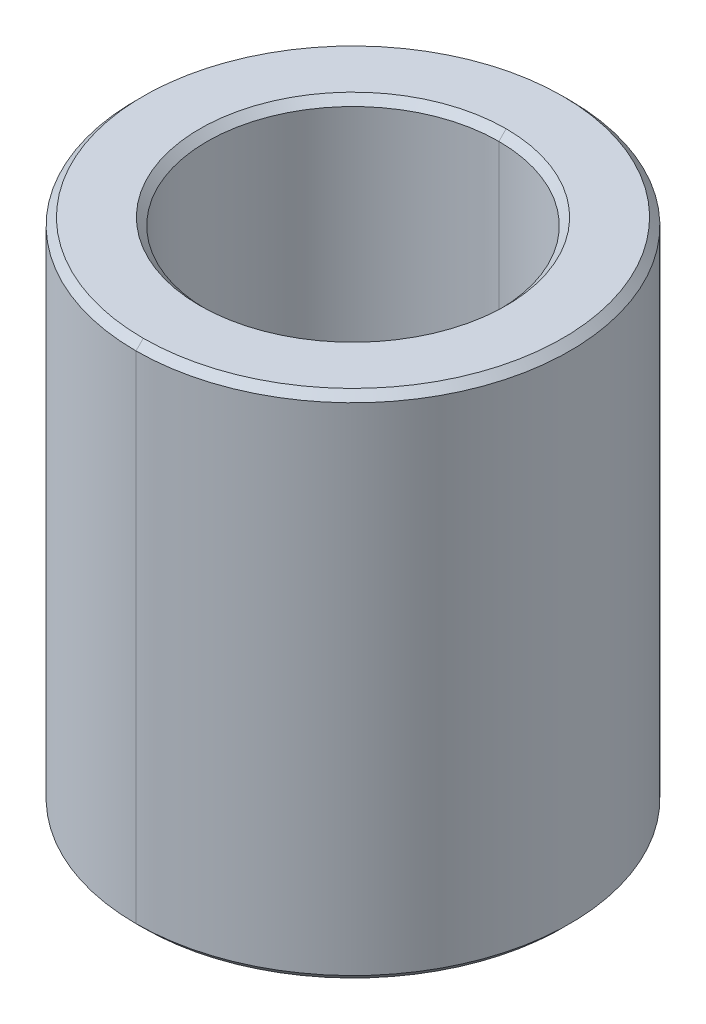
ISO-10303-21;
HEADER;
FILE_DESCRIPTION(('STEP AP214'),'2;1');
FILE_NAME('part.step','',(''),(''),'','','');
FILE_SCHEMA(('AUTOMOTIVE_DESIGN { 1 0 10303 214 1 1 1 1 }'));
ENDSEC;
DATA;
#1=APPLICATION_CONTEXT('core data for automotive mechanical design processes');
#2=APPLICATION_PROTOCOL_DEFINITION('international standard','automotive_design',2000,#1);
#3=PRODUCT_CONTEXT('',#1,'mechanical');
#4=PRODUCT('Part','Part','',(#3));
#5=PRODUCT_RELATED_PRODUCT_CATEGORY('part','',(#4));
#6=PRODUCT_DEFINITION_FORMATION('','',#4);
#7=PRODUCT_DEFINITION_CONTEXT('part definition',#1,'design');
#8=PRODUCT_DEFINITION('design','',#6,#7);
#9=PRODUCT_DEFINITION_SHAPE('','',#8);
#10=(LENGTH_UNIT() NAMED_UNIT(*) SI_UNIT(.MILLI.,.METRE.));
#11=(NAMED_UNIT(*) PLANE_ANGLE_UNIT() SI_UNIT($,.RADIAN.));
#12=(NAMED_UNIT(*) SI_UNIT($,.STERADIAN.) SOLID_ANGLE_UNIT());
#13=UNCERTAINTY_MEASURE_WITH_UNIT(LENGTH_MEASURE(1.E-05),#10,'distance_accuracy_value','');
#14=(GEOMETRIC_REPRESENTATION_CONTEXT(3) GLOBAL_UNCERTAINTY_ASSIGNED_CONTEXT((#13)) GLOBAL_UNIT_ASSIGNED_CONTEXT((#10,
#11,#12)) REPRESENTATION_CONTEXT('',''));
#15=CARTESIAN_POINT('',(0.,0.,0.));
#16=DIRECTION('',(0.,0.,1.));
#17=DIRECTION('',(1.,0.,0.));
#18=AXIS2_PLACEMENT_3D('',#15,#16,#17);
#19=CARTESIAN_POINT('',(0.,3.4,0.));
#20=DIRECTION('',(0.,1.,0.));
#21=DIRECTION('',(0.,0.,1.));
#22=AXIS2_PLACEMENT_3D('',#19,#20,#21);
#23=CONICAL_SURFACE('',#22,2.,0.78539816339745);
#24=DIRECTION('',(0.,0.707106781186546,-0.707106781186549));
#25=VECTOR('',#24,1.);
#26=CARTESIAN_POINT('',(0.,3.4,-2.));
#27=LINE('',#26,#25);
#28=CARTESIAN_POINT('',(0.,3.4,-2.));
#29=VERTEX_POINT('',#28);
#30=CARTESIAN_POINT('',(0.,3.5,-2.1));
#31=VERTEX_POINT('',#30);
#32=EDGE_CURVE('E159',#29,#31,#27,.T.);
#33=ORIENTED_EDGE('',*,*,#32,.F.);
#34=CARTESIAN_POINT('',(0.,3.4,0.));
#35=DIRECTION('',(0.,1.,0.));
#36=DIRECTION('',(0.,0.,1.));
#37=AXIS2_PLACEMENT_3D('',#34,#35,#36);
#38=CIRCLE('',#37,2.);
#39=CARTESIAN_POINT('',(0.,3.4,2.));
#40=VERTEX_POINT('',#39);
#41=EDGE_CURVE('E26',#40,#29,#38,.T.);
#42=ORIENTED_EDGE('',*,*,#41,.F.);
#43=DIRECTION('',(0.,0.707106781186546,0.707106781186549));
#44=VECTOR('',#43,1.);
#45=CARTESIAN_POINT('',(0.,3.4,2.));
#46=LINE('',#45,#44);
#47=CARTESIAN_POINT('',(0.,3.5,2.1));
#48=VERTEX_POINT('',#47);
#49=EDGE_CURVE('E148',#40,#48,#46,.T.);
#50=ORIENTED_EDGE('',*,*,#49,.T.);
#51=CARTESIAN_POINT('',(0.,3.5,0.));
#52=DIRECTION('',(0.,-1.,0.));
#53=DIRECTION('',(0.,0.,1.));
#54=AXIS2_PLACEMENT_3D('',#51,#52,#53);
#55=CIRCLE('',#54,2.1);
#56=EDGE_CURVE('E121',#31,#48,#55,.T.);
#57=ORIENTED_EDGE('',*,*,#56,.F.);
#58=EDGE_LOOP('',(#33,#42,#50,#57));
#59=FACE_BOUND('',#58,.T.);
#60=ADVANCED_FACE('F15',(#59),#23,.F.);
#61=CARTESIAN_POINT('',(0.,-3.5,0.));
#62=DIRECTION('',(0.,-1.,0.));
#63=DIRECTION('',(0.,0.,-1.));
#64=AXIS2_PLACEMENT_3D('',#61,#62,#63);
#65=CONICAL_SURFACE('',#64,2.1,0.785398163397443);
#66=DIRECTION('',(0.,-0.707106781186551,0.707106781186545));
#67=VECTOR('',#66,1.);
#68=CARTESIAN_POINT('',(0.,-3.5,2.1));
#69=LINE('',#68,#67);
#70=CARTESIAN_POINT('',(0.,-3.4,2.));
#71=VERTEX_POINT('',#70);
#72=CARTESIAN_POINT('',(0.,-3.5,2.1));
#73=VERTEX_POINT('',#72);
#74=EDGE_CURVE('E147',#71,#73,#69,.T.);
#75=ORIENTED_EDGE('',*,*,#74,.F.);
#76=CARTESIAN_POINT('',(0.,-3.4,0.));
#77=DIRECTION('',(0.,-1.,0.));
#78=DIRECTION('',(0.,0.,1.));
#79=AXIS2_PLACEMENT_3D('',#76,#77,#78);
#80=CIRCLE('',#79,2.);
#81=CARTESIAN_POINT('',(0.,-3.4,-2.));
#82=VERTEX_POINT('',#81);
#83=EDGE_CURVE('E10',#82,#71,#80,.T.);
#84=ORIENTED_EDGE('',*,*,#83,.F.);
#85=DIRECTION('',(0.,-0.707106781186551,-0.707106781186545));
#86=VECTOR('',#85,1.);
#87=CARTESIAN_POINT('',(0.,-3.5,-2.1));
#88=LINE('',#87,#86);
#89=CARTESIAN_POINT('',(0.,-3.5,-2.1));
#90=VERTEX_POINT('',#89);
#91=EDGE_CURVE('E133',#82,#90,#88,.T.);
#92=ORIENTED_EDGE('',*,*,#91,.T.);
#93=CARTESIAN_POINT('',(0.,-3.5,0.));
#94=DIRECTION('',(0.,1.,0.));
#95=DIRECTION('',(0.,0.,1.));
#96=AXIS2_PLACEMENT_3D('',#93,#94,#95);
#97=CIRCLE('',#96,2.1);
#98=EDGE_CURVE('E163',#73,#90,#97,.T.);
#99=ORIENTED_EDGE('',*,*,#98,.F.);
#100=EDGE_LOOP('',(#75,#84,#92,#99));
#101=FACE_BOUND('',#100,.T.);
#102=ADVANCED_FACE('F224',(#101),#65,.F.);
#103=CARTESIAN_POINT('',(0.,3.5,0.));
#104=DIRECTION('',(0.,-1.,0.));
#105=DIRECTION('',(0.,0.,-1.));
#106=AXIS2_PLACEMENT_3D('',#103,#104,#105);
#107=CONICAL_SURFACE('',#106,2.875,0.785398163397448);
#108=DIRECTION('',(0.,-0.707106781186548,0.707106781186548));
#109=VECTOR('',#108,1.);
#110=CARTESIAN_POINT('',(0.,3.5,2.875));
#111=LINE('',#110,#109);
#112=CARTESIAN_POINT('',(0.,3.5,2.875));
#113=VERTEX_POINT('',#112);
#114=CARTESIAN_POINT('',(0.,3.4,2.975));
#115=VERTEX_POINT('',#114);
#116=EDGE_CURVE('E116',#113,#115,#111,.T.);
#117=ORIENTED_EDGE('',*,*,#116,.F.);
#118=CARTESIAN_POINT('',(0.,3.5,0.));
#119=DIRECTION('',(0.,1.,0.));
#120=DIRECTION('',(0.,0.,1.));
#121=AXIS2_PLACEMENT_3D('',#118,#119,#120);
#122=CIRCLE('',#121,2.875);
#123=CARTESIAN_POINT('',(0.,3.5,-2.875));
#124=VERTEX_POINT('',#123);
#125=EDGE_CURVE('E110',#124,#113,#122,.T.);
#126=ORIENTED_EDGE('',*,*,#125,.F.);
#127=DIRECTION('',(0.,-0.707106781186548,-0.707106781186548));
#128=VECTOR('',#127,1.);
#129=CARTESIAN_POINT('',(0.,3.5,-2.875));
#130=LINE('',#129,#128);
#131=CARTESIAN_POINT('',(0.,3.4,-2.975));
#132=VERTEX_POINT('',#131);
#133=EDGE_CURVE('E113',#124,#132,#130,.T.);
#134=ORIENTED_EDGE('',*,*,#133,.T.);
#135=CARTESIAN_POINT('',(0.,3.4,0.));
#136=DIRECTION('',(0.,-1.,0.));
#137=DIRECTION('',(0.,0.,1.));
#138=AXIS2_PLACEMENT_3D('',#135,#136,#137);
#139=CIRCLE('',#138,2.975);
#140=EDGE_CURVE('E160',#115,#132,#139,.T.);
#141=ORIENTED_EDGE('',*,*,#140,.F.);
#142=EDGE_LOOP('',(#117,#126,#134,#141));
#143=FACE_BOUND('',#142,.T.);
#144=ADVANCED_FACE('F112',(#143),#107,.T.);
#145=CARTESIAN_POINT('',(0.,-3.4,0.));
#146=DIRECTION('',(0.,1.,0.));
#147=DIRECTION('',(0.,0.,1.));
#148=AXIS2_PLACEMENT_3D('',#145,#146,#147);
#149=CONICAL_SURFACE('',#148,2.975,0.785398163397455);
#150=DIRECTION('',(0.,0.707106781186543,-0.707106781186552));
#151=VECTOR('',#150,1.);
#152=CARTESIAN_POINT('',(0.,-3.4,-2.975));
#153=LINE('',#152,#151);
#154=CARTESIAN_POINT('',(0.,-3.5,-2.875));
#155=VERTEX_POINT('',#154);
#156=CARTESIAN_POINT('',(0.,-3.4,-2.975));
#157=VERTEX_POINT('',#156);
#158=EDGE_CURVE('E167',#155,#157,#153,.T.);
#159=ORIENTED_EDGE('',*,*,#158,.F.);
#160=CARTESIAN_POINT('',(0.,-3.5,0.));
#161=DIRECTION('',(0.,-1.,0.));
#162=DIRECTION('',(0.,0.,1.));
#163=AXIS2_PLACEMENT_3D('',#160,#161,#162);
#164=CIRCLE('',#163,2.875);
#165=CARTESIAN_POINT('',(0.,-3.5,2.875));
#166=VERTEX_POINT('',#165);
#167=EDGE_CURVE('E176',#166,#155,#164,.T.);
#168=ORIENTED_EDGE('',*,*,#167,.F.);
#169=DIRECTION('',(0.,0.707106781186543,0.707106781186552));
#170=VECTOR('',#169,1.);
#171=CARTESIAN_POINT('',(0.,-3.4,2.975));
#172=LINE('',#171,#170);
#173=CARTESIAN_POINT('',(0.,-3.4,2.975));
#174=VERTEX_POINT('',#173);
#175=EDGE_CURVE('E172',#166,#174,#172,.T.);
#176=ORIENTED_EDGE('',*,*,#175,.T.);
#177=CARTESIAN_POINT('',(0.,-3.4,0.));
#178=DIRECTION('',(0.,1.,0.));
#179=DIRECTION('',(0.,0.,1.));
#180=AXIS2_PLACEMENT_3D('',#177,#178,#179);
#181=CIRCLE('',#180,2.975);
#182=EDGE_CURVE('E41',#157,#174,#181,.T.);
#183=ORIENTED_EDGE('',*,*,#182,.F.);
#184=EDGE_LOOP('',(#159,#168,#176,#183));
#185=FACE_BOUND('',#184,.T.);
#186=ADVANCED_FACE('F235',(#185),#149,.T.);
#187=CARTESIAN_POINT('',(0.,3.5,0.));
#188=DIRECTION('',(0.,-1.,0.));
#189=DIRECTION('',(0.,0.,-1.));
#190=AXIS2_PLACEMENT_3D('',#187,#188,#189);
#191=CYLINDRICAL_SURFACE('',#190,2.);
#192=DIRECTION('',(0.,-1.,0.));
#193=VECTOR('',#192,1.);
#194=CARTESIAN_POINT('',(0.,3.5,2.));
#195=LINE('',#194,#193);
#196=EDGE_CURVE('E168',#40,#71,#195,.T.);
#197=ORIENTED_EDGE('',*,*,#196,.F.);
#198=ORIENTED_EDGE('',*,*,#41,.T.);
#199=DIRECTION('',(0.,-1.,0.));
#200=VECTOR('',#199,1.);
#201=CARTESIAN_POINT('',(0.,3.5,-2.));
#202=LINE('',#201,#200);
#203=EDGE_CURVE('E171',#29,#82,#202,.T.);
#204=ORIENTED_EDGE('',*,*,#203,.T.);
#205=ORIENTED_EDGE('',*,*,#83,.T.);
#206=EDGE_LOOP('',(#197,#198,#204,#205));
#207=FACE_BOUND('',#206,.T.);
#208=ADVANCED_FACE('F214',(#207),#191,.F.);
#209=CARTESIAN_POINT('',(0.,3.5,0.));
#210=DIRECTION('',(0.,-1.,0.));
#211=DIRECTION('',(0.,0.,-1.));
#212=AXIS2_PLACEMENT_3D('',#209,#210,#211);
#213=CYLINDRICAL_SURFACE('',#212,2.975);
#214=DIRECTION('',(0.,-1.,0.));
#215=VECTOR('',#214,1.);
#216=CARTESIAN_POINT('',(0.,3.5,2.975));
#217=LINE('',#216,#215);
#218=EDGE_CURVE('E151',#115,#174,#217,.T.);
#219=ORIENTED_EDGE('',*,*,#218,.F.);
#220=ORIENTED_EDGE('',*,*,#140,.T.);
#221=DIRECTION('',(0.,-1.,0.));
#222=VECTOR('',#221,1.);
#223=CARTESIAN_POINT('',(0.,3.5,-2.975));
#224=LINE('',#223,#222);
#225=EDGE_CURVE('E122',#132,#157,#224,.T.);
#226=ORIENTED_EDGE('',*,*,#225,.T.);
#227=ORIENTED_EDGE('',*,*,#182,.T.);
#228=EDGE_LOOP('',(#219,#220,#226,#227));
#229=FACE_BOUND('',#228,.T.);
#230=ADVANCED_FACE('F17',(#229),#213,.T.);
#231=CARTESIAN_POINT('',(0.,-3.5,0.));
#232=DIRECTION('',(0.,1.,0.));
#233=DIRECTION('',(1.,0.,0.));
#234=AXIS2_PLACEMENT_3D('',#231,#232,#233);
#235=PLANE('',#234);
#236=CARTESIAN_POINT('',(0.,-3.5,0.));
#237=DIRECTION('',(0.,1.,0.));
#238=DIRECTION('',(0.,0.,1.));
#239=AXIS2_PLACEMENT_3D('',#236,#237,#238);
#240=CIRCLE('',#239,2.1);
#241=EDGE_CURVE('E141',#90,#73,#240,.T.);
#242=ORIENTED_EDGE('',*,*,#241,.T.);
#243=ORIENTED_EDGE('',*,*,#98,.T.);
#244=EDGE_LOOP('',(#242,#243));
#245=FACE_BOUND('',#244,.T.);
#246=ORIENTED_EDGE('',*,*,#167,.T.);
#247=CARTESIAN_POINT('',(0.,-3.5,0.));
#248=DIRECTION('',(0.,-1.,0.));
#249=DIRECTION('',(0.,0.,1.));
#250=AXIS2_PLACEMENT_3D('',#247,#248,#249);
#251=CIRCLE('',#250,2.875);
#252=EDGE_CURVE('E129',#155,#166,#251,.T.);
#253=ORIENTED_EDGE('',*,*,#252,.T.);
#254=EDGE_LOOP('',(#246,#253));
#255=FACE_BOUND('',#254,.T.);
#256=ADVANCED_FACE('F226',(#245,#255),#235,.F.);
#257=CARTESIAN_POINT('',(0.,3.5,0.));
#258=DIRECTION('',(0.,1.,0.));
#259=DIRECTION('',(1.,0.,0.));
#260=AXIS2_PLACEMENT_3D('',#257,#258,#259);
#261=PLANE('',#260);
#262=CARTESIAN_POINT('',(0.,3.5,0.));
#263=DIRECTION('',(0.,-1.,0.));
#264=DIRECTION('',(0.,0.,1.));
#265=AXIS2_PLACEMENT_3D('',#262,#263,#264);
#266=CIRCLE('',#265,2.1);
#267=EDGE_CURVE('E180',#48,#31,#266,.T.);
#268=ORIENTED_EDGE('',*,*,#267,.T.);
#269=ORIENTED_EDGE('',*,*,#56,.T.);
#270=EDGE_LOOP('',(#268,#269));
#271=FACE_BOUND('',#270,.T.);
#272=ORIENTED_EDGE('',*,*,#125,.T.);
#273=CARTESIAN_POINT('',(0.,3.5,0.));
#274=DIRECTION('',(0.,1.,0.));
#275=DIRECTION('',(0.,0.,1.));
#276=AXIS2_PLACEMENT_3D('',#273,#274,#275);
#277=CIRCLE('',#276,2.875);
#278=EDGE_CURVE('E126',#113,#124,#277,.T.);
#279=ORIENTED_EDGE('',*,*,#278,.T.);
#280=EDGE_LOOP('',(#272,#279));
#281=FACE_BOUND('',#280,.T.);
#282=ADVANCED_FACE('F131',(#271,#281),#261,.T.);
#283=CARTESIAN_POINT('',(0.,3.5,0.));
#284=DIRECTION('',(0.,-1.,0.));
#285=DIRECTION('',(0.,0.,-1.));
#286=AXIS2_PLACEMENT_3D('',#283,#284,#285);
#287=CYLINDRICAL_SURFACE('',#286,2.975);
#288=CARTESIAN_POINT('',(0.,3.4,0.));
#289=DIRECTION('',(0.,-1.,0.));
#290=DIRECTION('',(0.,0.,1.));
#291=AXIS2_PLACEMENT_3D('',#288,#289,#290);
#292=CIRCLE('',#291,2.975);
#293=EDGE_CURVE('E19',#132,#115,#292,.T.);
#294=ORIENTED_EDGE('',*,*,#293,.T.);
#295=ORIENTED_EDGE('',*,*,#218,.T.);
#296=CARTESIAN_POINT('',(0.,-3.4,0.));
#297=DIRECTION('',(0.,1.,0.));
#298=DIRECTION('',(0.,0.,1.));
#299=AXIS2_PLACEMENT_3D('',#296,#297,#298);
#300=CIRCLE('',#299,2.975);
#301=EDGE_CURVE('E184',#174,#157,#300,.T.);
#302=ORIENTED_EDGE('',*,*,#301,.T.);
#303=ORIENTED_EDGE('',*,*,#225,.F.);
#304=EDGE_LOOP('',(#294,#295,#302,#303));
#305=FACE_BOUND('',#304,.T.);
#306=ADVANCED_FACE('F311',(#305),#287,.T.);
#307=CARTESIAN_POINT('',(0.,3.5,0.));
#308=DIRECTION('',(0.,-1.,0.));
#309=DIRECTION('',(0.,0.,-1.));
#310=AXIS2_PLACEMENT_3D('',#307,#308,#309);
#311=CYLINDRICAL_SURFACE('',#310,2.);
#312=CARTESIAN_POINT('',(0.,3.4,0.));
#313=DIRECTION('',(0.,1.,0.));
#314=DIRECTION('',(0.,0.,1.));
#315=AXIS2_PLACEMENT_3D('',#312,#313,#314);
#316=CIRCLE('',#315,2.);
#317=EDGE_CURVE('E155',#29,#40,#316,.T.);
#318=ORIENTED_EDGE('',*,*,#317,.T.);
#319=ORIENTED_EDGE('',*,*,#196,.T.);
#320=CARTESIAN_POINT('',(0.,-3.4,0.));
#321=DIRECTION('',(0.,-1.,0.));
#322=DIRECTION('',(0.,0.,1.));
#323=AXIS2_PLACEMENT_3D('',#320,#321,#322);
#324=CIRCLE('',#323,2.);
#325=EDGE_CURVE('E144',#71,#82,#324,.T.);
#326=ORIENTED_EDGE('',*,*,#325,.T.);
#327=ORIENTED_EDGE('',*,*,#203,.F.);
#328=EDGE_LOOP('',(#318,#319,#326,#327));
#329=FACE_BOUND('',#328,.T.);
#330=ADVANCED_FACE('F221',(#329),#311,.F.);
#331=CARTESIAN_POINT('',(0.,-3.4,0.));
#332=DIRECTION('',(0.,1.,0.));
#333=DIRECTION('',(0.,0.,1.));
#334=AXIS2_PLACEMENT_3D('',#331,#332,#333);
#335=CONICAL_SURFACE('',#334,2.975,0.785398163397455);
#336=ORIENTED_EDGE('',*,*,#252,.F.);
#337=ORIENTED_EDGE('',*,*,#158,.T.);
#338=ORIENTED_EDGE('',*,*,#301,.F.);
#339=ORIENTED_EDGE('',*,*,#175,.F.);
#340=EDGE_LOOP('',(#336,#337,#338,#339));
#341=FACE_BOUND('',#340,.T.);
#342=ADVANCED_FACE('F238',(#341),#335,.T.);
#343=CARTESIAN_POINT('',(0.,3.5,0.));
#344=DIRECTION('',(0.,-1.,0.));
#345=DIRECTION('',(0.,0.,-1.));
#346=AXIS2_PLACEMENT_3D('',#343,#344,#345);
#347=CONICAL_SURFACE('',#346,2.875,0.785398163397448);
#348=ORIENTED_EDGE('',*,*,#278,.F.);
#349=ORIENTED_EDGE('',*,*,#116,.T.);
#350=ORIENTED_EDGE('',*,*,#293,.F.);
#351=ORIENTED_EDGE('',*,*,#133,.F.);
#352=EDGE_LOOP('',(#348,#349,#350,#351));
#353=FACE_BOUND('',#352,.T.);
#354=ADVANCED_FACE('F125',(#353),#347,.T.);
#355=CARTESIAN_POINT('',(0.,-3.5,0.));
#356=DIRECTION('',(0.,-1.,0.));
#357=DIRECTION('',(0.,0.,-1.));
#358=AXIS2_PLACEMENT_3D('',#355,#356,#357);
#359=CONICAL_SURFACE('',#358,2.1,0.785398163397443);
#360=ORIENTED_EDGE('',*,*,#325,.F.);
#361=ORIENTED_EDGE('',*,*,#74,.T.);
#362=ORIENTED_EDGE('',*,*,#241,.F.);
#363=ORIENTED_EDGE('',*,*,#91,.F.);
#364=EDGE_LOOP('',(#360,#361,#362,#363));
#365=FACE_BOUND('',#364,.T.);
#366=ADVANCED_FACE('F220',(#365),#359,.F.);
#367=CARTESIAN_POINT('',(0.,3.4,0.));
#368=DIRECTION('',(0.,1.,0.));
#369=DIRECTION('',(0.,0.,1.));
#370=AXIS2_PLACEMENT_3D('',#367,#368,#369);
#371=CONICAL_SURFACE('',#370,2.,0.78539816339745);
#372=ORIENTED_EDGE('',*,*,#317,.F.);
#373=ORIENTED_EDGE('',*,*,#32,.T.);
#374=ORIENTED_EDGE('',*,*,#267,.F.);
#375=ORIENTED_EDGE('',*,*,#49,.F.);
#376=EDGE_LOOP('',(#372,#373,#374,#375));
#377=FACE_BOUND('',#376,.T.);
#378=ADVANCED_FACE('F290',(#377),#371,.F.);
#379=CLOSED_SHELL('',(#60,#102,#144,#186,#208,#230,#256,#282,#306,#330,#342,#354,#366,#378));
#380=MANIFOLD_SOLID_BREP('B1',#379);
#381=ADVANCED_BREP_SHAPE_REPRESENTATION('',(#18,#380),#14);
#382=SHAPE_DEFINITION_REPRESENTATION(#9,#381);
ENDSEC;
END-ISO-10303-21;
